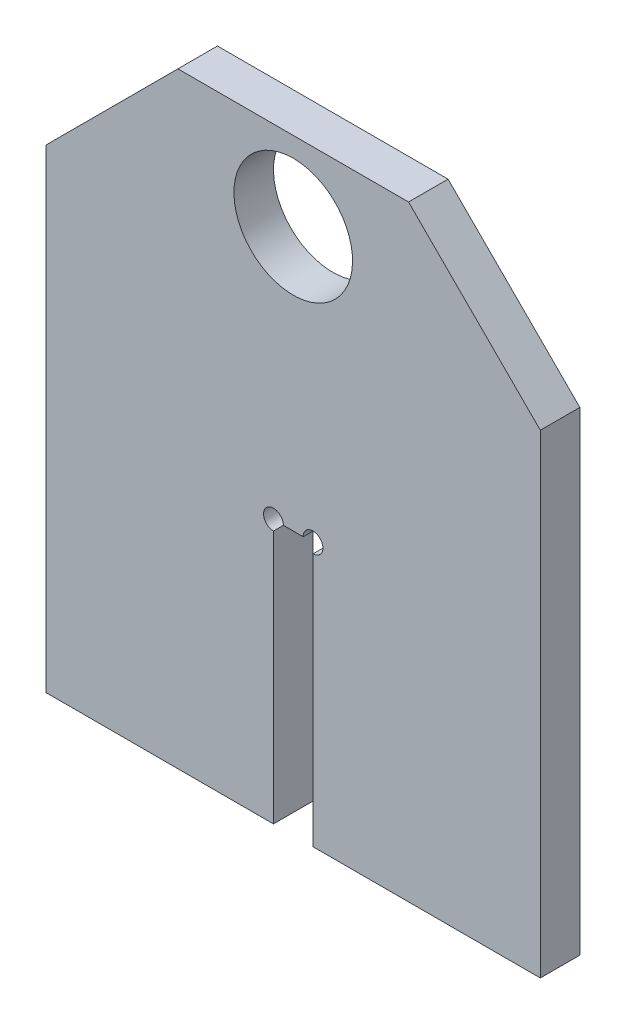
ISO-10303-21;
HEADER;
FILE_DESCRIPTION(('STEP AP214'),'2;1');
FILE_NAME('part.step','',(''),(''),'','','');
FILE_SCHEMA(('AUTOMOTIVE_DESIGN { 1 0 10303 214 1 1 1 1 }'));
ENDSEC;
DATA;
#1=APPLICATION_CONTEXT('core data for automotive mechanical design processes');
#2=APPLICATION_PROTOCOL_DEFINITION('international standard','automotive_design',2000,#1);
#3=PRODUCT_CONTEXT('',#1,'mechanical');
#4=PRODUCT('Part','Part','',(#3));
#5=PRODUCT_RELATED_PRODUCT_CATEGORY('part','',(#4));
#6=PRODUCT_DEFINITION_FORMATION('','',#4);
#7=PRODUCT_DEFINITION_CONTEXT('part definition',#1,'design');
#8=PRODUCT_DEFINITION('design','',#6,#7);
#9=PRODUCT_DEFINITION_SHAPE('','',#8);
#10=(LENGTH_UNIT() NAMED_UNIT(*) SI_UNIT(.MILLI.,.METRE.));
#11=(NAMED_UNIT(*) PLANE_ANGLE_UNIT() SI_UNIT($,.RADIAN.));
#12=(NAMED_UNIT(*) SI_UNIT($,.STERADIAN.) SOLID_ANGLE_UNIT());
#13=UNCERTAINTY_MEASURE_WITH_UNIT(LENGTH_MEASURE(1.E-05),#10,'distance_accuracy_value','');
#14=(GEOMETRIC_REPRESENTATION_CONTEXT(3) GLOBAL_UNCERTAINTY_ASSIGNED_CONTEXT((#13)) GLOBAL_UNIT_ASSIGNED_CONTEXT((#10,
#11,#12)) REPRESENTATION_CONTEXT('',''));
#15=CARTESIAN_POINT('',(0.,0.,0.));
#16=DIRECTION('',(0.,0.,1.));
#17=DIRECTION('',(1.,0.,0.));
#18=AXIS2_PLACEMENT_3D('',#15,#16,#17);
#19=CARTESIAN_POINT('',(0.,0.,0.));
#20=DIRECTION('',(0.,0.,1.));
#21=DIRECTION('',(0.,-1.,0.));
#22=AXIS2_PLACEMENT_3D('',#19,#20,#21);
#23=PLANE('',#22);
#24=DIRECTION('',(1.,0.,0.));
#25=VECTOR('',#24,1.);
#26=CARTESIAN_POINT('',(0.,200.,0.));
#27=LINE('',#26,#25);
#28=CARTESIAN_POINT('',(1.50000000001339,200.,0.));
#29=VERTEX_POINT('',#28);
#30=CARTESIAN_POINT('',(-1.49999999998646,200.,0.));
#31=VERTEX_POINT('',#30);
#32=EDGE_CURVE('E80',#29,#31,#27,.F.);
#33=ORIENTED_EDGE('',*,*,#32,.T.);
#34=CARTESIAN_POINT('',(-2.99999999998644,200.,0.));
#35=DIRECTION('',(0.,0.,-1.));
#36=DIRECTION('',(0.,1.,0.));
#37=AXIS2_PLACEMENT_3D('',#34,#35,#36);
#38=CIRCLE('',#37,1.49999999999998);
#39=CARTESIAN_POINT('',(-2.99999999998642,198.5,0.));
#40=VERTEX_POINT('',#39);
#41=EDGE_CURVE('E71',#31,#40,#38,.F.);
#42=ORIENTED_EDGE('',*,*,#41,.T.);
#43=DIRECTION('',(0.,-1.,0.));
#44=VECTOR('',#43,1.);
#45=CARTESIAN_POINT('',(-2.99999999998754,0.,0.));
#46=LINE('',#45,#44);
#47=CARTESIAN_POINT('',(-2.9999999999866,160.,0.));
#48=VERTEX_POINT('',#47);
#49=EDGE_CURVE('E64',#40,#48,#46,.T.);
#50=ORIENTED_EDGE('',*,*,#49,.T.);
#51=DIRECTION('',(-1.,0.,0.));
#52=VECTOR('',#51,1.);
#53=CARTESIAN_POINT('',(-2.48065457064683E-13,160.,0.));
#54=LINE('',#53,#52);
#55=CARTESIAN_POINT('',(-37.4999999999997,160.,0.));
#56=VERTEX_POINT('',#55);
#57=EDGE_CURVE('E136',#48,#56,#54,.T.);
#58=ORIENTED_EDGE('',*,*,#57,.T.);
#59=DIRECTION('',(0.,-1.,0.));
#60=VECTOR('',#59,1.);
#61=CARTESIAN_POINT('',(-37.4999999999997,0.,0.));
#62=LINE('',#61,#60);
#63=CARTESIAN_POINT('',(-37.4999999999998,232.000025877442,0.));
#64=VERTEX_POINT('',#63);
#65=EDGE_CURVE('E130',#64,#56,#62,.T.);
#66=ORIENTED_EDGE('',*,*,#65,.F.);
#67=DIRECTION('',(0.707106781186542,0.707106781186553,0.));
#68=VECTOR('',#67,1.);
#69=CARTESIAN_POINT('',(-134.750012938719,134.750012938721,0.));
#70=LINE('',#69,#68);
#71=CARTESIAN_POINT('',(-17.5,252.000025877441,0.));
#72=VERTEX_POINT('',#71);
#73=EDGE_CURVE('E124',#64,#72,#70,.T.);
#74=ORIENTED_EDGE('',*,*,#73,.T.);
#75=DIRECTION('',(1.,0.,0.));
#76=VECTOR('',#75,1.);
#77=CARTESIAN_POINT('',(-1.09287578986539E-13,252.000025877441,0.));
#78=LINE('',#77,#76);
#79=CARTESIAN_POINT('',(17.4999999999996,252.000025877441,0.));
#80=VERTEX_POINT('',#79);
#81=EDGE_CURVE('E118',#72,#80,#78,.T.);
#82=ORIENTED_EDGE('',*,*,#81,.T.);
#83=DIRECTION('',(0.707106781186543,-0.707106781186552,0.));
#84=VECTOR('',#83,1.);
#85=CARTESIAN_POINT('',(134.750012938719,134.75001293872,0.));
#86=LINE('',#85,#84);
#87=CARTESIAN_POINT('',(37.4999999999995,232.000025877441,0.));
#88=VERTEX_POINT('',#87);
#89=EDGE_CURVE('E112',#80,#88,#86,.T.);
#90=ORIENTED_EDGE('',*,*,#89,.T.);
#91=DIRECTION('',(0.,-1.,0.));
#92=VECTOR('',#91,1.);
#93=CARTESIAN_POINT('',(37.4999999999996,0.,0.));
#94=LINE('',#93,#92);
#95=CARTESIAN_POINT('',(37.4999999999994,160.,0.));
#96=VERTEX_POINT('',#95);
#97=EDGE_CURVE('E106',#88,#96,#94,.T.);
#98=ORIENTED_EDGE('',*,*,#97,.T.);
#99=DIRECTION('',(-1.,0.,0.));
#100=VECTOR('',#99,1.);
#101=CARTESIAN_POINT('',(0.,160.,0.));
#102=LINE('',#101,#100);
#103=CARTESIAN_POINT('',(3.00000000001328,160.,0.));
#104=VERTEX_POINT('',#103);
#105=EDGE_CURVE('E100',#96,#104,#102,.T.);
#106=ORIENTED_EDGE('',*,*,#105,.T.);
#107=DIRECTION('',(0.,1.,0.));
#108=VECTOR('',#107,1.);
#109=CARTESIAN_POINT('',(3.00000000001276,0.,0.));
#110=LINE('',#109,#108);
#111=CARTESIAN_POINT('',(3.00000000001342,198.5,0.));
#112=VERTEX_POINT('',#111);
#113=EDGE_CURVE('E94',#104,#112,#110,.T.);
#114=ORIENTED_EDGE('',*,*,#113,.T.);
#115=CARTESIAN_POINT('',(3.00000000001337,200.,0.));
#116=DIRECTION('',(0.,0.,-1.));
#117=DIRECTION('',(0.,1.,0.));
#118=AXIS2_PLACEMENT_3D('',#115,#116,#117);
#119=CIRCLE('',#118,1.49999999999998);
#120=EDGE_CURVE('E82',#112,#29,#119,.F.);
#121=ORIENTED_EDGE('',*,*,#120,.T.);
#122=EDGE_LOOP('',(#33,#42,#50,#58,#66,#74,#82,#90,#98,#106,#114,#121));
#123=FACE_BOUND('',#122,.T.);
#124=CARTESIAN_POINT('',(9.64995892933224E-05,239.99993796999,0.));
#125=DIRECTION('',(0.,0.,-1.));
#126=DIRECTION('',(0.,1.,0.));
#127=AXIS2_PLACEMENT_3D('',#124,#125,#126);
#128=CIRCLE('',#127,8.99999999999988);
#129=CARTESIAN_POINT('',(9.64995892933224E-05,248.99993796999,0.));
#130=VERTEX_POINT('',#129);
#131=EDGE_CURVE('E19',#130,#130,#128,.F.);
#132=ORIENTED_EDGE('',*,*,#131,.T.);
#133=EDGE_LOOP('',(#132));
#134=FACE_BOUND('',#133,.T.);
#135=ADVANCED_FACE('F16',(#123,#134),#23,.F.);
#136=CARTESIAN_POINT('',(9.64995892933224E-05,239.99993796999,124.697113534619));
#137=DIRECTION('',(0.,0.,-1.));
#138=DIRECTION('',(0.,1.,0.));
#139=AXIS2_PLACEMENT_3D('',#136,#137,#138);
#140=CYLINDRICAL_SURFACE('',#139,8.99999999999988);
#141=CARTESIAN_POINT('',(9.64995892933224E-05,239.99993796999,5.99999999999998));
#142=DIRECTION('',(0.,0.,-1.));
#143=DIRECTION('',(0.,1.,0.));
#144=AXIS2_PLACEMENT_3D('',#141,#142,#143);
#145=CIRCLE('',#144,8.99999999999988);
#146=CARTESIAN_POINT('',(9.64995892933224E-05,248.99993796999,5.99999999999998));
#147=VERTEX_POINT('',#146);
#148=EDGE_CURVE('E147',#147,#147,#145,.F.);
#149=ORIENTED_EDGE('',*,*,#148,.T.);
#150=EDGE_LOOP('',(#149));
#151=FACE_BOUND('',#150,.T.);
#152=ORIENTED_EDGE('',*,*,#131,.F.);
#153=EDGE_LOOP('',(#152));
#154=FACE_BOUND('',#153,.T.);
#155=ADVANCED_FACE('F323',(#151,#154),#140,.F.);
#156=CARTESIAN_POINT('',(0.,200.,124.697113534619));
#157=DIRECTION('',(0.,1.,0.));
#158=DIRECTION('',(0.,0.,1.));
#159=AXIS2_PLACEMENT_3D('',#156,#157,#158);
#160=PLANE('',#159);
#161=DIRECTION('',(-1.,0.,0.));
#162=VECTOR('',#161,1.);
#163=CARTESIAN_POINT('',(-855.599205235686,200.,5.99999999999825));
#164=LINE('',#163,#162);
#165=CARTESIAN_POINT('',(1.50000000001339,200.,5.99999999999914));
#166=VERTEX_POINT('',#165);
#167=CARTESIAN_POINT('',(-1.49999999998648,200.,5.99999999999917));
#168=VERTEX_POINT('',#167);
#169=EDGE_CURVE('E89',#166,#168,#164,.T.);
#170=ORIENTED_EDGE('',*,*,#169,.T.);
#171=DIRECTION('',(0.,0.,-1.));
#172=VECTOR('',#171,1.);
#173=CARTESIAN_POINT('',(-1.49999999998646,200.,124.697113534619));
#174=LINE('',#173,#172);
#175=EDGE_CURVE('E75',#168,#31,#174,.T.);
#176=ORIENTED_EDGE('',*,*,#175,.T.);
#177=ORIENTED_EDGE('',*,*,#32,.F.);
#178=DIRECTION('',(0.,0.,-1.));
#179=VECTOR('',#178,1.);
#180=CARTESIAN_POINT('',(1.50000000001339,200.,124.697113534619));
#181=LINE('',#180,#179);
#182=EDGE_CURVE('E150',#29,#166,#181,.F.);
#183=ORIENTED_EDGE('',*,*,#182,.T.);
#184=EDGE_LOOP('',(#170,#176,#177,#183));
#185=FACE_BOUND('',#184,.T.);
#186=ADVANCED_FACE('F88',(#185),#160,.F.);
#187=CARTESIAN_POINT('',(-2.99999999998644,200.,124.697113534619));
#188=DIRECTION('',(0.,0.,-1.));
#189=DIRECTION('',(0.,1.,0.));
#190=AXIS2_PLACEMENT_3D('',#187,#188,#189);
#191=CYLINDRICAL_SURFACE('',#190,1.49999999999998);
#192=CARTESIAN_POINT('',(-2.99999999998644,200.,5.99999999999995));
#193=DIRECTION('',(0.,0.,-1.));
#194=DIRECTION('',(0.,1.,0.));
#195=AXIS2_PLACEMENT_3D('',#192,#193,#194);
#196=CIRCLE('',#195,1.49999999999998);
#197=CARTESIAN_POINT('',(-2.99999999998636,198.5,5.99999999999917));
#198=VERTEX_POINT('',#197);
#199=EDGE_CURVE('E144',#168,#198,#196,.F.);
#200=ORIENTED_EDGE('',*,*,#199,.T.);
#201=DIRECTION('',(0.,0.,1.));
#202=VECTOR('',#201,1.);
#203=CARTESIAN_POINT('',(-2.99999999998642,198.5,124.697113534619));
#204=LINE('',#203,#202);
#205=EDGE_CURVE('E77',#198,#40,#204,.F.);
#206=ORIENTED_EDGE('',*,*,#205,.T.);
#207=ORIENTED_EDGE('',*,*,#41,.F.);
#208=ORIENTED_EDGE('',*,*,#175,.F.);
#209=EDGE_LOOP('',(#200,#206,#207,#208));
#210=FACE_BOUND('',#209,.T.);
#211=ADVANCED_FACE('F73',(#210),#191,.F.);
#212=CARTESIAN_POINT('',(-2.99999999998754,0.,124.697113534619));
#213=DIRECTION('',(-1.,0.,0.));
#214=DIRECTION('',(0.,-1.,0.));
#215=AXIS2_PLACEMENT_3D('',#212,#213,#214);
#216=PLANE('',#215);
#217=DIRECTION('',(0.,1.,0.));
#218=VECTOR('',#217,1.);
#219=CARTESIAN_POINT('',(-2.99999999998635,-1.11022302462516E-13,5.99999999999837));
#220=LINE('',#219,#218);
#221=CARTESIAN_POINT('',(-2.99999999998643,160.,5.99999999999839));
#222=VERTEX_POINT('',#221);
#223=EDGE_CURVE('E146',#198,#222,#220,.F.);
#224=ORIENTED_EDGE('',*,*,#223,.T.);
#225=DIRECTION('',(0.,0.,1.));
#226=VECTOR('',#225,1.);
#227=CARTESIAN_POINT('',(-2.99999999998658,160.,124.697113534619));
#228=LINE('',#227,#226);
#229=EDGE_CURVE('E133',#222,#48,#228,.F.);
#230=ORIENTED_EDGE('',*,*,#229,.T.);
#231=ORIENTED_EDGE('',*,*,#49,.F.);
#232=ORIENTED_EDGE('',*,*,#205,.F.);
#233=EDGE_LOOP('',(#224,#230,#231,#232));
#234=FACE_BOUND('',#233,.T.);
#235=ADVANCED_FACE('F224',(#234),#216,.F.);
#236=CARTESIAN_POINT('',(-2.48065457064683E-13,160.,124.697113534619));
#237=DIRECTION('',(0.,1.,0.));
#238=DIRECTION('',(-1.,0.,0.));
#239=AXIS2_PLACEMENT_3D('',#236,#237,#238);
#240=PLANE('',#239);
#241=DIRECTION('',(-1.,0.,0.));
#242=VECTOR('',#241,1.);
#243=CARTESIAN_POINT('',(-855.599205235686,160.,5.99999999999825));
#244=LINE('',#243,#242);
#245=CARTESIAN_POINT('',(-37.4999999999995,160.,5.99999999999838));
#246=VERTEX_POINT('',#245);
#247=EDGE_CURVE('E210',#222,#246,#244,.T.);
#248=ORIENTED_EDGE('',*,*,#247,.T.);
#249=DIRECTION('',(0.,0.,1.));
#250=VECTOR('',#249,1.);
#251=CARTESIAN_POINT('',(-37.4999999999997,160.,124.697113534619));
#252=LINE('',#251,#250);
#253=EDGE_CURVE('E127',#56,#246,#252,.T.);
#254=ORIENTED_EDGE('',*,*,#253,.F.);
#255=ORIENTED_EDGE('',*,*,#57,.F.);
#256=ORIENTED_EDGE('',*,*,#229,.F.);
#257=EDGE_LOOP('',(#248,#254,#255,#256));
#258=FACE_BOUND('',#257,.T.);
#259=ADVANCED_FACE('F228',(#258),#240,.F.);
#260=CARTESIAN_POINT('',(-37.4999999999997,0.,124.697113534619));
#261=DIRECTION('',(-1.,0.,0.));
#262=DIRECTION('',(0.,-1.,0.));
#263=AXIS2_PLACEMENT_3D('',#260,#261,#262);
#264=PLANE('',#263);
#265=ORIENTED_EDGE('',*,*,#65,.T.);
#266=ORIENTED_EDGE('',*,*,#253,.T.);
#267=DIRECTION('',(0.,1.,0.));
#268=VECTOR('',#267,1.);
#269=CARTESIAN_POINT('',(-37.4999999999994,-1.11022302462516E-13,5.99999999999836));
#270=LINE('',#269,#268);
#271=CARTESIAN_POINT('',(-37.4999999999995,232.000025877441,5.99999999999838));
#272=VERTEX_POINT('',#271);
#273=EDGE_CURVE('E201',#246,#272,#270,.T.);
#274=ORIENTED_EDGE('',*,*,#273,.T.);
#275=DIRECTION('',(0.,0.,1.));
#276=VECTOR('',#275,1.);
#277=CARTESIAN_POINT('',(-37.4999999999998,232.000025877442,124.697113534619));
#278=LINE('',#277,#276);
#279=EDGE_CURVE('E121',#272,#64,#278,.F.);
#280=ORIENTED_EDGE('',*,*,#279,.T.);
#281=EDGE_LOOP('',(#265,#266,#274,#280));
#282=FACE_BOUND('',#281,.T.);
#283=ADVANCED_FACE('F242',(#282),#264,.T.);
#284=CARTESIAN_POINT('',(-134.750012938719,134.750012938721,124.697113534619));
#285=DIRECTION('',(0.707106781186553,-0.707106781186542,0.));
#286=DIRECTION('',(0.707106781186542,0.707106781186553,0.));
#287=AXIS2_PLACEMENT_3D('',#284,#285,#286);
#288=PLANE('',#287);
#289=DIRECTION('',(0.707106781186538,0.707106781186557,0.));
#290=VECTOR('',#289,1.);
#291=CARTESIAN_POINT('',(-37.4999999999993,232.000025877441,5.99999999999839));
#292=LINE('',#291,#290);
#293=CARTESIAN_POINT('',(-17.4999999999999,252.000025877441,5.9999999999984));
#294=VERTEX_POINT('',#293);
#295=EDGE_CURVE('E192',#272,#294,#292,.T.);
#296=ORIENTED_EDGE('',*,*,#295,.T.);
#297=DIRECTION('',(0.,0.,-1.));
#298=VECTOR('',#297,1.);
#299=CARTESIAN_POINT('',(-17.4999999999998,252.000025877441,124.697113534619));
#300=LINE('',#299,#298);
#301=EDGE_CURVE('E115',#294,#72,#300,.T.);
#302=ORIENTED_EDGE('',*,*,#301,.T.);
#303=ORIENTED_EDGE('',*,*,#73,.F.);
#304=ORIENTED_EDGE('',*,*,#279,.F.);
#305=EDGE_LOOP('',(#296,#302,#303,#304));
#306=FACE_BOUND('',#305,.T.);
#307=ADVANCED_FACE('F259',(#306),#288,.F.);
#308=CARTESIAN_POINT('',(-1.09287578986539E-13,252.000025877441,124.697113534619));
#309=DIRECTION('',(0.,-1.,0.));
#310=DIRECTION('',(0.,0.,-1.));
#311=AXIS2_PLACEMENT_3D('',#308,#309,#310);
#312=PLANE('',#311);
#313=DIRECTION('',(-1.,0.,0.));
#314=VECTOR('',#313,1.);
#315=CARTESIAN_POINT('',(-855.599205235686,252.000025877441,5.99999999999826));
#316=LINE('',#315,#314);
#317=CARTESIAN_POINT('',(17.4999999999997,252.000025877441,5.99999999999841));
#318=VERTEX_POINT('',#317);
#319=EDGE_CURVE('E183',#294,#318,#316,.F.);
#320=ORIENTED_EDGE('',*,*,#319,.T.);
#321=DIRECTION('',(0.,0.,1.));
#322=VECTOR('',#321,1.);
#323=CARTESIAN_POINT('',(17.4999999999996,252.000025877441,124.697113534619));
#324=LINE('',#323,#322);
#325=EDGE_CURVE('E109',#318,#80,#324,.F.);
#326=ORIENTED_EDGE('',*,*,#325,.T.);
#327=ORIENTED_EDGE('',*,*,#81,.F.);
#328=ORIENTED_EDGE('',*,*,#301,.F.);
#329=EDGE_LOOP('',(#320,#326,#327,#328));
#330=FACE_BOUND('',#329,.T.);
#331=ADVANCED_FACE('F261',(#330),#312,.F.);
#332=CARTESIAN_POINT('',(134.750012938719,134.75001293872,124.697113534619));
#333=DIRECTION('',(-0.707106781186552,-0.707106781186543,0.));
#334=DIRECTION('',(0.707106781186543,-0.707106781186552,0.));
#335=AXIS2_PLACEMENT_3D('',#332,#333,#334);
#336=PLANE('',#335);
#337=DIRECTION('',(0.707106781186549,-0.707106781186546,0.));
#338=VECTOR('',#337,1.);
#339=CARTESIAN_POINT('',(17.4999999999996,252.000025877441,5.99999999999841));
#340=LINE('',#339,#338);
#341=CARTESIAN_POINT('',(37.4999999999996,232.000025877441,5.99999999999841));
#342=VERTEX_POINT('',#341);
#343=EDGE_CURVE('E174',#318,#342,#340,.T.);
#344=ORIENTED_EDGE('',*,*,#343,.T.);
#345=DIRECTION('',(0.,0.,1.));
#346=VECTOR('',#345,1.);
#347=CARTESIAN_POINT('',(37.4999999999996,232.000025877441,124.697113534619));
#348=LINE('',#347,#346);
#349=EDGE_CURVE('E103',#342,#88,#348,.F.);
#350=ORIENTED_EDGE('',*,*,#349,.T.);
#351=ORIENTED_EDGE('',*,*,#89,.F.);
#352=ORIENTED_EDGE('',*,*,#325,.F.);
#353=EDGE_LOOP('',(#344,#350,#351,#352));
#354=FACE_BOUND('',#353,.T.);
#355=ADVANCED_FACE('F269',(#354),#336,.F.);
#356=CARTESIAN_POINT('',(37.4999999999996,0.,124.697113534619));
#357=DIRECTION('',(-1.,0.,0.));
#358=DIRECTION('',(0.,-1.,0.));
#359=AXIS2_PLACEMENT_3D('',#356,#357,#358);
#360=PLANE('',#359);
#361=DIRECTION('',(0.,1.,0.));
#362=VECTOR('',#361,1.);
#363=CARTESIAN_POINT('',(37.4999999999995,-1.11022302462516E-13,5.99999999999838));
#364=LINE('',#363,#362);
#365=CARTESIAN_POINT('',(37.4999999999995,160.,5.9999999999984));
#366=VERTEX_POINT('',#365);
#367=EDGE_CURVE('E165',#342,#366,#364,.F.);
#368=ORIENTED_EDGE('',*,*,#367,.T.);
#369=DIRECTION('',(0.,0.,1.));
#370=VECTOR('',#369,1.);
#371=CARTESIAN_POINT('',(37.4999999999993,160.,124.697113534619));
#372=LINE('',#371,#370);
#373=EDGE_CURVE('E97',#366,#96,#372,.F.);
#374=ORIENTED_EDGE('',*,*,#373,.T.);
#375=ORIENTED_EDGE('',*,*,#97,.F.);
#376=ORIENTED_EDGE('',*,*,#349,.F.);
#377=EDGE_LOOP('',(#368,#374,#375,#376));
#378=FACE_BOUND('',#377,.T.);
#379=ADVANCED_FACE('F283',(#378),#360,.F.);
#380=CARTESIAN_POINT('',(0.,160.,124.697113534619));
#381=DIRECTION('',(0.,1.,0.));
#382=DIRECTION('',(-1.,0.,0.));
#383=AXIS2_PLACEMENT_3D('',#380,#381,#382);
#384=PLANE('',#383);
#385=DIRECTION('',(-1.,0.,0.));
#386=VECTOR('',#385,1.);
#387=CARTESIAN_POINT('',(-855.599205235686,160.,5.99999999999825));
#388=LINE('',#387,#386);
#389=CARTESIAN_POINT('',(3.00000000001331,160.,5.99999999999839));
#390=VERTEX_POINT('',#389);
#391=EDGE_CURVE('E162',#366,#390,#388,.T.);
#392=ORIENTED_EDGE('',*,*,#391,.T.);
#393=DIRECTION('',(0.,0.,1.));
#394=VECTOR('',#393,1.);
#395=CARTESIAN_POINT('',(3.00000000001328,160.,124.697113534619));
#396=LINE('',#395,#394);
#397=EDGE_CURVE('E96',#390,#104,#396,.F.);
#398=ORIENTED_EDGE('',*,*,#397,.T.);
#399=ORIENTED_EDGE('',*,*,#105,.F.);
#400=ORIENTED_EDGE('',*,*,#373,.F.);
#401=EDGE_LOOP('',(#392,#398,#399,#400));
#402=FACE_BOUND('',#401,.T.);
#403=ADVANCED_FACE('F285',(#402),#384,.F.);
#404=CARTESIAN_POINT('',(3.00000000001276,0.,124.697113534619));
#405=DIRECTION('',(1.,0.,0.));
#406=DIRECTION('',(0.,1.,0.));
#407=AXIS2_PLACEMENT_3D('',#404,#405,#406);
#408=PLANE('',#407);
#409=DIRECTION('',(0.,1.,0.));
#410=VECTOR('',#409,1.);
#411=CARTESIAN_POINT('',(3.00000000001333,-1.11022302462516E-13,5.99999999999837));
#412=LINE('',#411,#410);
#413=CARTESIAN_POINT('',(3.00000000001342,198.5,5.99999999999914));
#414=VERTEX_POINT('',#413);
#415=EDGE_CURVE('E25',#390,#414,#412,.T.);
#416=ORIENTED_EDGE('',*,*,#415,.T.);
#417=DIRECTION('',(0.,0.,-1.));
#418=VECTOR('',#417,1.);
#419=CARTESIAN_POINT('',(3.00000000001346,198.5,124.697113534619));
#420=LINE('',#419,#418);
#421=EDGE_CURVE('E33',#414,#112,#420,.T.);
#422=ORIENTED_EDGE('',*,*,#421,.T.);
#423=ORIENTED_EDGE('',*,*,#113,.F.);
#424=ORIENTED_EDGE('',*,*,#397,.F.);
#425=EDGE_LOOP('',(#416,#422,#423,#424));
#426=FACE_BOUND('',#425,.T.);
#427=ADVANCED_FACE('F292',(#426),#408,.F.);
#428=CARTESIAN_POINT('',(3.00000000001337,200.,124.697113534619));
#429=DIRECTION('',(0.,0.,-1.));
#430=DIRECTION('',(0.,1.,0.));
#431=AXIS2_PLACEMENT_3D('',#428,#429,#430);
#432=CYLINDRICAL_SURFACE('',#431,1.49999999999998);
#433=ORIENTED_EDGE('',*,*,#182,.F.);
#434=ORIENTED_EDGE('',*,*,#120,.F.);
#435=ORIENTED_EDGE('',*,*,#421,.F.);
#436=CARTESIAN_POINT('',(3.00000000001337,200.,5.99999999999988));
#437=DIRECTION('',(0.,0.,-1.));
#438=DIRECTION('',(0.,1.,0.));
#439=AXIS2_PLACEMENT_3D('',#436,#437,#438);
#440=CIRCLE('',#439,1.49999999999998);
#441=EDGE_CURVE('E11',#414,#166,#440,.F.);
#442=ORIENTED_EDGE('',*,*,#441,.T.);
#443=EDGE_LOOP('',(#433,#434,#435,#442));
#444=FACE_BOUND('',#443,.T.);
#445=ADVANCED_FACE('F293',(#444),#432,.F.);
#446=CARTESIAN_POINT('',(-855.599205235686,-1.11022302462516E-13,5.99999999999823));
#447=DIRECTION('',(0.,0.,-1.));
#448=DIRECTION('',(-1.,0.,0.));
#449=AXIS2_PLACEMENT_3D('',#446,#447,#448);
#450=PLANE('',#449);
#451=ORIENTED_EDGE('',*,*,#415,.F.);
#452=ORIENTED_EDGE('',*,*,#391,.F.);
#453=ORIENTED_EDGE('',*,*,#367,.F.);
#454=ORIENTED_EDGE('',*,*,#343,.F.);
#455=ORIENTED_EDGE('',*,*,#319,.F.);
#456=ORIENTED_EDGE('',*,*,#295,.F.);
#457=ORIENTED_EDGE('',*,*,#273,.F.);
#458=ORIENTED_EDGE('',*,*,#247,.F.);
#459=ORIENTED_EDGE('',*,*,#223,.F.);
#460=ORIENTED_EDGE('',*,*,#199,.F.);
#461=ORIENTED_EDGE('',*,*,#169,.F.);
#462=ORIENTED_EDGE('',*,*,#441,.F.);
#463=EDGE_LOOP('',(#451,#452,#453,#454,#455,#456,#457,#458,#459,#460,#461,#462));
#464=FACE_BOUND('',#463,.T.);
#465=ORIENTED_EDGE('',*,*,#148,.F.);
#466=EDGE_LOOP('',(#465));
#467=FACE_BOUND('',#466,.T.);
#468=ADVANCED_FACE('F235',(#464,#467),#450,.F.);
#469=CLOSED_SHELL('',(#135,#155,#186,#211,#235,#259,#283,#307,#331,#355,#379,#403,#427,#445,#468));
#470=MANIFOLD_SOLID_BREP('B1',#469);
#471=ADVANCED_BREP_SHAPE_REPRESENTATION('',(#18,#470),#14);
#472=SHAPE_DEFINITION_REPRESENTATION(#9,#471);
ENDSEC;
END-ISO-10303-21;
